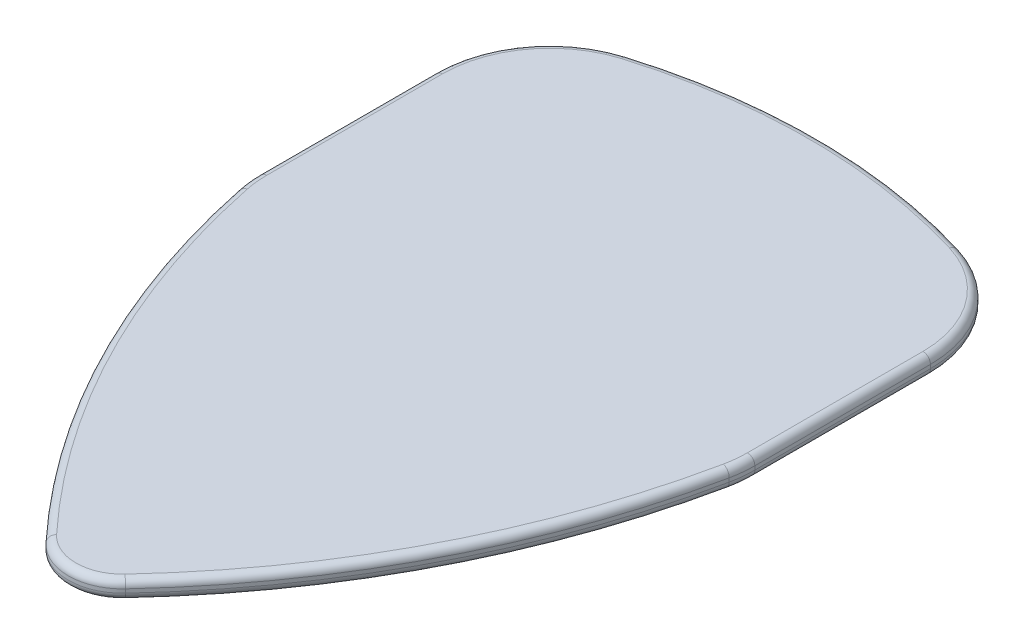
ISO-10303-21;
HEADER;
FILE_DESCRIPTION(('STEP AP214'),'2;1');
FILE_NAME('part.step','',(''),(''),'','','');
FILE_SCHEMA(('AUTOMOTIVE_DESIGN { 1 0 10303 214 1 1 1 1 }'));
ENDSEC;
DATA;
#1=APPLICATION_CONTEXT('core data for automotive mechanical design processes');
#2=APPLICATION_PROTOCOL_DEFINITION('international standard','automotive_design',2000,#1);
#3=PRODUCT_CONTEXT('',#1,'mechanical');
#4=PRODUCT('Part','Part','',(#3));
#5=PRODUCT_RELATED_PRODUCT_CATEGORY('part','',(#4));
#6=PRODUCT_DEFINITION_FORMATION('','',#4);
#7=PRODUCT_DEFINITION_CONTEXT('part definition',#1,'design');
#8=PRODUCT_DEFINITION('design','',#6,#7);
#9=PRODUCT_DEFINITION_SHAPE('','',#8);
#10=(LENGTH_UNIT() NAMED_UNIT(*) SI_UNIT(.MILLI.,.METRE.));
#11=(NAMED_UNIT(*) PLANE_ANGLE_UNIT() SI_UNIT($,.RADIAN.));
#12=(NAMED_UNIT(*) SI_UNIT($,.STERADIAN.) SOLID_ANGLE_UNIT());
#13=UNCERTAINTY_MEASURE_WITH_UNIT(LENGTH_MEASURE(1.E-05),#10,'distance_accuracy_value','');
#14=(GEOMETRIC_REPRESENTATION_CONTEXT(3) GLOBAL_UNCERTAINTY_ASSIGNED_CONTEXT((#13)) GLOBAL_UNIT_ASSIGNED_CONTEXT((#10,
#11,#12)) REPRESENTATION_CONTEXT('',''));
#15=CARTESIAN_POINT('',(0.,0.,0.));
#16=DIRECTION('',(0.,0.,1.));
#17=DIRECTION('',(1.,0.,0.));
#18=AXIS2_PLACEMENT_3D('',#15,#16,#17);
#19=CARTESIAN_POINT('',(-7.09730033956618,1.,-23.4285878338835));
#20=DIRECTION('',(0.,-1.,0.));
#21=DIRECTION('',(0.,0.,-1.));
#22=AXIS2_PLACEMENT_3D('',#19,#20,#21);
#23=CYLINDRICAL_SURFACE('',#22,6.14);
#24=DIRECTION('',(0.,-1.,0.));
#25=VECTOR('',#24,1.);
#26=CARTESIAN_POINT('',(-13.2373003395662,1.,-23.4285878338835));
#27=LINE('',#26,#25);
#28=CARTESIAN_POINT('',(-13.2373003395662,0.6,-23.4285878338835));
#29=VERTEX_POINT('',#28);
#30=CARTESIAN_POINT('',(-13.2373003395662,0.4,-23.4285878338835));
#31=VERTEX_POINT('',#30);
#32=EDGE_CURVE('E349',#29,#31,#27,.T.);
#33=ORIENTED_EDGE('',*,*,#32,.T.);
#34=CARTESIAN_POINT('',(-7.09730033956618,0.4,-23.4285878338835));
#35=DIRECTION('',(0.,-1.,0.));
#36=DIRECTION('',(0.,0.,-1.));
#37=AXIS2_PLACEMENT_3D('',#34,#35,#36);
#38=CIRCLE('',#37,6.14);
#39=CARTESIAN_POINT('',(-13.11,0.4,-22.1847860838369));
#40=VERTEX_POINT('',#39);
#41=EDGE_CURVE('E266',#31,#40,#38,.F.);
#42=ORIENTED_EDGE('',*,*,#41,.T.);
#43=DIRECTION('',(0.,-1.,0.));
#44=VECTOR('',#43,1.);
#45=CARTESIAN_POINT('',(-13.11,1.,-22.1847860838369));
#46=LINE('',#45,#44);
#47=CARTESIAN_POINT('',(-13.11,0.6,-22.1847860838369));
#48=VERTEX_POINT('',#47);
#49=EDGE_CURVE('E193',#48,#40,#46,.T.);
#50=ORIENTED_EDGE('',*,*,#49,.F.);
#51=CARTESIAN_POINT('',(-7.09730033956618,0.6,-23.4285878338835));
#52=DIRECTION('',(0.,-1.,0.));
#53=DIRECTION('',(0.,0.,-1.));
#54=AXIS2_PLACEMENT_3D('',#51,#52,#53);
#55=CIRCLE('',#54,6.14);
#56=EDGE_CURVE('E264',#48,#29,#55,.T.);
#57=ORIENTED_EDGE('',*,*,#56,.T.);
#58=EDGE_LOOP('',(#33,#42,#50,#57));
#59=FACE_BOUND('',#58,.T.);
#60=ADVANCED_FACE('F33',(#59),#23,.T.);
#61=CARTESIAN_POINT('',(7.09730033956618,1.,-23.4285878338835));
#62=DIRECTION('',(0.,-1.,0.));
#63=DIRECTION('',(0.,0.,-1.));
#64=AXIS2_PLACEMENT_3D('',#61,#62,#63);
#65=CYLINDRICAL_SURFACE('',#64,6.14);
#66=DIRECTION('',(0.,-1.,0.));
#67=VECTOR('',#66,1.);
#68=CARTESIAN_POINT('',(13.11,1.,-22.1847860838369));
#69=LINE('',#68,#67);
#70=CARTESIAN_POINT('',(13.11,0.6,-22.1847860838369));
#71=VERTEX_POINT('',#70);
#72=CARTESIAN_POINT('',(13.11,0.4,-22.1847860838369));
#73=VERTEX_POINT('',#72);
#74=EDGE_CURVE('E342',#71,#73,#69,.T.);
#75=ORIENTED_EDGE('',*,*,#74,.T.);
#76=CARTESIAN_POINT('',(7.09730033956618,0.4,-23.4285878338835));
#77=DIRECTION('',(0.,-1.,0.));
#78=DIRECTION('',(0.,0.,-1.));
#79=AXIS2_PLACEMENT_3D('',#76,#77,#78);
#80=CIRCLE('',#79,6.14);
#81=CARTESIAN_POINT('',(13.2373003395662,0.4,-23.4285878338835));
#82=VERTEX_POINT('',#81);
#83=EDGE_CURVE('E241',#73,#82,#80,.F.);
#84=ORIENTED_EDGE('',*,*,#83,.T.);
#85=DIRECTION('',(0.,-1.,0.));
#86=VECTOR('',#85,1.);
#87=CARTESIAN_POINT('',(13.2373003395662,1.,-23.4285878338835));
#88=LINE('',#87,#86);
#89=CARTESIAN_POINT('',(13.2373003395662,0.6,-23.4285878338835));
#90=VERTEX_POINT('',#89);
#91=EDGE_CURVE('E354',#90,#82,#88,.T.);
#92=ORIENTED_EDGE('',*,*,#91,.F.);
#93=CARTESIAN_POINT('',(7.09730033956618,0.6,-23.4285878338835));
#94=DIRECTION('',(0.,-1.,0.));
#95=DIRECTION('',(0.,0.,-1.));
#96=AXIS2_PLACEMENT_3D('',#93,#94,#95);
#97=CIRCLE('',#96,6.14);
#98=EDGE_CURVE('E239',#90,#71,#97,.T.);
#99=ORIENTED_EDGE('',*,*,#98,.T.);
#100=EDGE_LOOP('',(#75,#84,#92,#99));
#101=FACE_BOUND('',#100,.T.);
#102=ADVANCED_FACE('F424',(#101),#65,.T.);
#103=CARTESIAN_POINT('',(30.3498714869794,1.,-31.17500133906));
#104=DIRECTION('',(0.,-1.,0.));
#105=DIRECTION('',(0.,0.,-1.));
#106=AXIS2_PLACEMENT_3D('',#103,#104,#105);
#107=CYLINDRICAL_SURFACE('',#106,44.3800000000001);
#108=ORIENTED_EDGE('',*,*,#49,.T.);
#109=CARTESIAN_POINT('',(30.3498714869794,0.4,-31.17500133906));
#110=DIRECTION('',(0.,-1.,0.));
#111=DIRECTION('',(0.,0.,-1.));
#112=AXIS2_PLACEMENT_3D('',#109,#110,#111);
#113=CIRCLE('',#112,44.3800000000001);
#114=CARTESIAN_POINT('',(-2.1218569747406,0.4,-0.92320386009465));
#115=VERTEX_POINT('',#114);
#116=EDGE_CURVE('E192',#40,#115,#113,.F.);
#117=ORIENTED_EDGE('',*,*,#116,.T.);
#118=DIRECTION('',(0.,-1.,0.));
#119=VECTOR('',#118,1.);
#120=CARTESIAN_POINT('',(-2.1218569747406,1.,-0.92320386009465));
#121=LINE('',#120,#119);
#122=CARTESIAN_POINT('',(-2.1218569747406,0.6,-0.92320386009465));
#123=VERTEX_POINT('',#122);
#124=EDGE_CURVE('E174',#123,#115,#121,.T.);
#125=ORIENTED_EDGE('',*,*,#124,.F.);
#126=CARTESIAN_POINT('',(30.3498714869794,0.6,-31.17500133906));
#127=DIRECTION('',(0.,-1.,0.));
#128=DIRECTION('',(0.,0.,-1.));
#129=AXIS2_PLACEMENT_3D('',#126,#127,#128);
#130=CIRCLE('',#129,44.3800000000001);
#131=EDGE_CURVE('E189',#123,#48,#130,.T.);
#132=ORIENTED_EDGE('',*,*,#131,.T.);
#133=EDGE_LOOP('',(#108,#117,#125,#132));
#134=FACE_BOUND('',#133,.T.);
#135=ADVANCED_FACE('F187',(#134),#107,.T.);
#136=CARTESIAN_POINT('',(0.,1.,-2.9));
#137=DIRECTION('',(0.,-1.,0.));
#138=DIRECTION('',(0.,0.,-1.));
#139=AXIS2_PLACEMENT_3D('',#136,#137,#138);
#140=CYLINDRICAL_SURFACE('',#139,2.9);
#141=ORIENTED_EDGE('',*,*,#124,.T.);
#142=CARTESIAN_POINT('',(0.,0.4,-2.9));
#143=DIRECTION('',(0.,-1.,0.));
#144=DIRECTION('',(0.,0.,-1.));
#145=AXIS2_PLACEMENT_3D('',#142,#143,#144);
#146=CIRCLE('',#145,2.9);
#147=CARTESIAN_POINT('',(2.12185697474061,0.4,-0.923203860094646));
#148=VERTEX_POINT('',#147);
#149=EDGE_CURVE('E181',#115,#148,#146,.F.);
#150=ORIENTED_EDGE('',*,*,#149,.T.);
#151=DIRECTION('',(0.,-1.,0.));
#152=VECTOR('',#151,1.);
#153=CARTESIAN_POINT('',(2.12185697474061,1.,-0.923203860094646));
#154=LINE('',#153,#152);
#155=CARTESIAN_POINT('',(2.12185697474061,0.6,-0.923203860094646));
#156=VERTEX_POINT('',#155);
#157=EDGE_CURVE('E176',#156,#148,#154,.T.);
#158=ORIENTED_EDGE('',*,*,#157,.F.);
#159=CARTESIAN_POINT('',(0.,0.6,-2.9));
#160=DIRECTION('',(0.,-1.,0.));
#161=DIRECTION('',(0.,0.,-1.));
#162=AXIS2_PLACEMENT_3D('',#159,#160,#161);
#163=CIRCLE('',#162,2.9);
#164=EDGE_CURVE('E171',#156,#123,#163,.T.);
#165=ORIENTED_EDGE('',*,*,#164,.T.);
#166=EDGE_LOOP('',(#141,#150,#158,#165));
#167=FACE_BOUND('',#166,.T.);
#168=ADVANCED_FACE('F173',(#167),#140,.T.);
#169=CARTESIAN_POINT('',(-30.3498714869793,1.,-31.17500133906));
#170=DIRECTION('',(0.,-1.,0.));
#171=DIRECTION('',(0.,0.,-1.));
#172=AXIS2_PLACEMENT_3D('',#169,#170,#171);
#173=CYLINDRICAL_SURFACE('',#172,44.38);
#174=ORIENTED_EDGE('',*,*,#157,.T.);
#175=CARTESIAN_POINT('',(-30.3498714869793,0.4,-31.17500133906));
#176=DIRECTION('',(0.,-1.,0.));
#177=DIRECTION('',(0.,0.,-1.));
#178=AXIS2_PLACEMENT_3D('',#175,#176,#177);
#179=CIRCLE('',#178,44.38);
#180=EDGE_CURVE('E237',#148,#73,#179,.F.);
#181=ORIENTED_EDGE('',*,*,#180,.T.);
#182=ORIENTED_EDGE('',*,*,#74,.F.);
#183=CARTESIAN_POINT('',(-30.3498714869793,0.6,-31.17500133906));
#184=DIRECTION('',(0.,-1.,0.));
#185=DIRECTION('',(0.,0.,-1.));
#186=AXIS2_PLACEMENT_3D('',#183,#184,#185);
#187=CIRCLE('',#186,44.38);
#188=EDGE_CURVE('E235',#71,#156,#187,.T.);
#189=ORIENTED_EDGE('',*,*,#188,.T.);
#190=EDGE_LOOP('',(#174,#181,#182,#189));
#191=FACE_BOUND('',#190,.T.);
#192=ADVANCED_FACE('F339',(#191),#173,.T.);
#193=CARTESIAN_POINT('',(-3.54865016978309,1.,-11.7142939169418));
#194=DIRECTION('',(0.,-1.,0.));
#195=DIRECTION('',(0.,0.,-1.));
#196=AXIS2_PLACEMENT_3D('',#193,#194,#195);
#197=PLANE('',#196);
#198=CARTESIAN_POINT('',(0.,1.,-9.38000000000001));
#199=DIRECTION('',(0.,-1.,0.));
#200=DIRECTION('',(0.,0.,-1.));
#201=AXIS2_PLACEMENT_3D('',#198,#199,#200);
#202=CIRCLE('',#201,30.22);
#203=CARTESIAN_POINT('',(8.76145491265074,1.,-38.3020557328415));
#204=VERTEX_POINT('',#203);
#205=CARTESIAN_POINT('',(-8.76145491265075,1.,-38.3020557328415));
#206=VERTEX_POINT('',#205);
#207=EDGE_CURVE('E42',#204,#206,#202,.F.);
#208=ORIENTED_EDGE('',*,*,#207,.T.);
#209=CARTESIAN_POINT('',(-7.09730033956618,1.,-32.8085878338835));
#210=DIRECTION('',(0.,-1.,0.));
#211=DIRECTION('',(0.,0.,-1.));
#212=AXIS2_PLACEMENT_3D('',#209,#210,#211);
#213=CIRCLE('',#212,5.74);
#214=CARTESIAN_POINT('',(-12.8373003395662,1.,-32.8085878338835));
#215=VERTEX_POINT('',#214);
#216=EDGE_CURVE('E11',#206,#215,#213,.F.);
#217=ORIENTED_EDGE('',*,*,#216,.T.);
#218=DIRECTION('',(0.,0.,1.));
#219=VECTOR('',#218,1.);
#220=CARTESIAN_POINT('',(-12.8373003395662,1.,-11.7142939169418));
#221=LINE('',#220,#219);
#222=CARTESIAN_POINT('',(-12.8373003395662,1.,-23.4285878338835));
#223=VERTEX_POINT('',#222);
#224=EDGE_CURVE('E268',#215,#223,#221,.T.);
#225=ORIENTED_EDGE('',*,*,#224,.T.);
#226=CARTESIAN_POINT('',(-7.09730033956618,1.,-23.4285878338835));
#227=DIRECTION('',(0.,-1.,0.));
#228=DIRECTION('',(0.,0.,-1.));
#229=AXIS2_PLACEMENT_3D('',#226,#227,#228);
#230=CIRCLE('',#229,5.73999999999999);
#231=CARTESIAN_POINT('',(-12.7182931817307,1.,-22.2658155138073));
#232=VERTEX_POINT('',#231);
#233=EDGE_CURVE('E270',#223,#232,#230,.F.);
#234=ORIENTED_EDGE('',*,*,#233,.T.);
#235=CARTESIAN_POINT('',(30.3498714869794,1.,-31.17500133906));
#236=DIRECTION('',(0.,-1.,0.));
#237=DIRECTION('',(0.,0.,-1.));
#238=AXIS2_PLACEMENT_3D('',#235,#236,#237);
#239=CIRCLE('',#238,43.9800000000001);
#240=CARTESIAN_POINT('',(-1.82918704719017,1.,-1.19586539663332));
#241=VERTEX_POINT('',#240);
#242=EDGE_CURVE('E272',#232,#241,#239,.F.);
#243=ORIENTED_EDGE('',*,*,#242,.T.);
#244=CARTESIAN_POINT('',(0.,1.,-2.9));
#245=DIRECTION('',(0.,-1.,0.));
#246=DIRECTION('',(0.,0.,-1.));
#247=AXIS2_PLACEMENT_3D('',#244,#245,#246);
#248=CIRCLE('',#247,2.5);
#249=CARTESIAN_POINT('',(1.82918704719017,1.,-1.19586539663332));
#250=VERTEX_POINT('',#249);
#251=EDGE_CURVE('E199',#241,#250,#248,.F.);
#252=ORIENTED_EDGE('',*,*,#251,.T.);
#253=CARTESIAN_POINT('',(-30.3498714869793,1.,-31.17500133906));
#254=DIRECTION('',(0.,-1.,0.));
#255=DIRECTION('',(0.,0.,-1.));
#256=AXIS2_PLACEMENT_3D('',#253,#254,#255);
#257=CIRCLE('',#256,43.98);
#258=CARTESIAN_POINT('',(12.7182931817307,1.,-22.2658155138073));
#259=VERTEX_POINT('',#258);
#260=EDGE_CURVE('E275',#250,#259,#257,.F.);
#261=ORIENTED_EDGE('',*,*,#260,.T.);
#262=CARTESIAN_POINT('',(7.09730033956618,1.,-23.4285878338835));
#263=DIRECTION('',(0.,-1.,0.));
#264=DIRECTION('',(0.,0.,-1.));
#265=AXIS2_PLACEMENT_3D('',#262,#263,#264);
#266=CIRCLE('',#265,5.74);
#267=CARTESIAN_POINT('',(12.8373003395662,1.,-23.4285878338835));
#268=VERTEX_POINT('',#267);
#269=EDGE_CURVE('E277',#259,#268,#266,.F.);
#270=ORIENTED_EDGE('',*,*,#269,.T.);
#271=DIRECTION('',(0.,0.,1.));
#272=VECTOR('',#271,1.);
#273=CARTESIAN_POINT('',(12.8373003395662,1.,-32.8085878338835));
#274=LINE('',#273,#272);
#275=CARTESIAN_POINT('',(12.8373003395662,1.,-32.8085878338835));
#276=VERTEX_POINT('',#275);
#277=EDGE_CURVE('E279',#268,#276,#274,.F.);
#278=ORIENTED_EDGE('',*,*,#277,.T.);
#279=CARTESIAN_POINT('',(7.09730033956618,1.,-32.8085878338835));
#280=DIRECTION('',(0.,-1.,0.));
#281=DIRECTION('',(0.,0.,-1.));
#282=AXIS2_PLACEMENT_3D('',#279,#280,#281);
#283=CIRCLE('',#282,5.74);
#284=EDGE_CURVE('E53',#276,#204,#283,.F.);
#285=ORIENTED_EDGE('',*,*,#284,.T.);
#286=EDGE_LOOP('',(#208,#217,#225,#234,#243,#252,#261,#270,#278,#285));
#287=FACE_BOUND('',#286,.T.);
#288=ADVANCED_FACE('F659',(#287),#197,.F.);
#289=CARTESIAN_POINT('',(-3.54865016978309,0.,-11.7142939169418));
#290=DIRECTION('',(0.,-1.,0.));
#291=DIRECTION('',(0.,0.,-1.));
#292=AXIS2_PLACEMENT_3D('',#289,#290,#291);
#293=PLANE('',#292);
#294=CARTESIAN_POINT('',(0.,0.,-2.9));
#295=DIRECTION('',(0.,-1.,0.));
#296=DIRECTION('',(0.,0.,-1.));
#297=AXIS2_PLACEMENT_3D('',#294,#295,#296);
#298=CIRCLE('',#297,2.5);
#299=CARTESIAN_POINT('',(1.82918704719018,0.,-1.19586539663331));
#300=VERTEX_POINT('',#299);
#301=CARTESIAN_POINT('',(-1.82918704719017,0.,-1.19586539663332));
#302=VERTEX_POINT('',#301);
#303=EDGE_CURVE('E230',#300,#302,#298,.T.);
#304=ORIENTED_EDGE('',*,*,#303,.T.);
#305=CARTESIAN_POINT('',(30.3498714869794,0.,-31.17500133906));
#306=DIRECTION('',(0.,-1.,0.));
#307=DIRECTION('',(0.,0.,-1.));
#308=AXIS2_PLACEMENT_3D('',#305,#306,#307);
#309=CIRCLE('',#308,43.9800000000001);
#310=CARTESIAN_POINT('',(-12.7182931817307,0.,-22.2658155138073));
#311=VERTEX_POINT('',#310);
#312=EDGE_CURVE('E182',#302,#311,#309,.T.);
#313=ORIENTED_EDGE('',*,*,#312,.T.);
#314=CARTESIAN_POINT('',(-7.09730033956618,0.,-23.4285878338835));
#315=DIRECTION('',(0.,-1.,0.));
#316=DIRECTION('',(0.,0.,-1.));
#317=AXIS2_PLACEMENT_3D('',#314,#315,#316);
#318=CIRCLE('',#317,5.73999999999999);
#319=CARTESIAN_POINT('',(-12.8373003395662,0.,-23.4285878338835));
#320=VERTEX_POINT('',#319);
#321=EDGE_CURVE('E211',#311,#320,#318,.T.);
#322=ORIENTED_EDGE('',*,*,#321,.T.);
#323=DIRECTION('',(0.,0.,1.));
#324=VECTOR('',#323,1.);
#325=CARTESIAN_POINT('',(-12.8373003395662,0.,-32.8085878338835));
#326=LINE('',#325,#324);
#327=CARTESIAN_POINT('',(-12.8373003395662,0.,-32.8085878338835));
#328=VERTEX_POINT('',#327);
#329=EDGE_CURVE('E216',#320,#328,#326,.F.);
#330=ORIENTED_EDGE('',*,*,#329,.T.);
#331=CARTESIAN_POINT('',(-7.09730033956618,0.,-32.8085878338835));
#332=DIRECTION('',(0.,-1.,0.));
#333=DIRECTION('',(0.,0.,-1.));
#334=AXIS2_PLACEMENT_3D('',#331,#332,#333);
#335=CIRCLE('',#334,5.74);
#336=CARTESIAN_POINT('',(-8.76145491265075,0.,-38.3020557328415));
#337=VERTEX_POINT('',#336);
#338=EDGE_CURVE('E218',#328,#337,#335,.T.);
#339=ORIENTED_EDGE('',*,*,#338,.T.);
#340=CARTESIAN_POINT('',(0.,0.,-9.38000000000001));
#341=DIRECTION('',(0.,-1.,0.));
#342=DIRECTION('',(0.,0.,-1.));
#343=AXIS2_PLACEMENT_3D('',#340,#341,#342);
#344=CIRCLE('',#343,30.22);
#345=CARTESIAN_POINT('',(8.76145491265074,0.,-38.3020557328415));
#346=VERTEX_POINT('',#345);
#347=EDGE_CURVE('E220',#337,#346,#344,.T.);
#348=ORIENTED_EDGE('',*,*,#347,.T.);
#349=CARTESIAN_POINT('',(7.09730033956618,0.,-32.8085878338835));
#350=DIRECTION('',(0.,-1.,0.));
#351=DIRECTION('',(0.,0.,-1.));
#352=AXIS2_PLACEMENT_3D('',#349,#350,#351);
#353=CIRCLE('',#352,5.74);
#354=CARTESIAN_POINT('',(12.8373003395662,0.,-32.8085878338835));
#355=VERTEX_POINT('',#354);
#356=EDGE_CURVE('E222',#346,#355,#353,.T.);
#357=ORIENTED_EDGE('',*,*,#356,.T.);
#358=DIRECTION('',(0.,0.,1.));
#359=VECTOR('',#358,1.);
#360=CARTESIAN_POINT('',(12.8373003395662,0.,-11.7142939169418));
#361=LINE('',#360,#359);
#362=CARTESIAN_POINT('',(12.8373003395662,0.,-23.4285878338835));
#363=VERTEX_POINT('',#362);
#364=EDGE_CURVE('E224',#355,#363,#361,.T.);
#365=ORIENTED_EDGE('',*,*,#364,.T.);
#366=CARTESIAN_POINT('',(7.09730033956618,0.,-23.4285878338835));
#367=DIRECTION('',(0.,-1.,0.));
#368=DIRECTION('',(0.,0.,-1.));
#369=AXIS2_PLACEMENT_3D('',#366,#367,#368);
#370=CIRCLE('',#369,5.74);
#371=CARTESIAN_POINT('',(12.7182931817307,0.,-22.2658155138073));
#372=VERTEX_POINT('',#371);
#373=EDGE_CURVE('E226',#363,#372,#370,.T.);
#374=ORIENTED_EDGE('',*,*,#373,.T.);
#375=CARTESIAN_POINT('',(-30.3498714869793,0.,-31.17500133906));
#376=DIRECTION('',(0.,-1.,0.));
#377=DIRECTION('',(0.,0.,-1.));
#378=AXIS2_PLACEMENT_3D('',#375,#376,#377);
#379=CIRCLE('',#378,43.98);
#380=EDGE_CURVE('E228',#372,#300,#379,.T.);
#381=ORIENTED_EDGE('',*,*,#380,.T.);
#382=EDGE_LOOP('',(#304,#313,#322,#330,#339,#348,#357,#365,#374,#381));
#383=FACE_BOUND('',#382,.T.);
#384=ADVANCED_FACE('F436',(#383),#293,.T.);
#385=CARTESIAN_POINT('',(-7.09730033956618,1.,-32.8085878338835));
#386=DIRECTION('',(0.,-1.,0.));
#387=DIRECTION('',(0.,0.,-1.));
#388=AXIS2_PLACEMENT_3D('',#385,#386,#387);
#389=CYLINDRICAL_SURFACE('',#388,6.14);
#390=DIRECTION('',(0.,-1.,0.));
#391=VECTOR('',#390,1.);
#392=CARTESIAN_POINT('',(-8.87742387244758,1.,-38.6848757954866));
#393=LINE('',#392,#391);
#394=CARTESIAN_POINT('',(-8.87742387244758,0.6,-38.6848757954866));
#395=VERTEX_POINT('',#394);
#396=CARTESIAN_POINT('',(-8.87742387244758,0.4,-38.6848757954866));
#397=VERTEX_POINT('',#396);
#398=EDGE_CURVE('E311',#395,#397,#393,.T.);
#399=ORIENTED_EDGE('',*,*,#398,.T.);
#400=CARTESIAN_POINT('',(-7.09730033956618,0.4,-32.8085878338835));
#401=DIRECTION('',(0.,-1.,0.));
#402=DIRECTION('',(0.,0.,-1.));
#403=AXIS2_PLACEMENT_3D('',#400,#401,#402);
#404=CIRCLE('',#403,6.14);
#405=CARTESIAN_POINT('',(-13.2373003395662,0.4,-32.8085878338835));
#406=VERTEX_POINT('',#405);
#407=EDGE_CURVE('E258',#397,#406,#404,.F.);
#408=ORIENTED_EDGE('',*,*,#407,.T.);
#409=DIRECTION('',(0.,-1.,0.));
#410=VECTOR('',#409,1.);
#411=CARTESIAN_POINT('',(-13.2373003395662,1.,-32.8085878338835));
#412=LINE('',#411,#410);
#413=CARTESIAN_POINT('',(-13.2373003395662,0.6,-32.8085878338835));
#414=VERTEX_POINT('',#413);
#415=EDGE_CURVE('E345',#414,#406,#412,.T.);
#416=ORIENTED_EDGE('',*,*,#415,.F.);
#417=CARTESIAN_POINT('',(-7.09730033956618,0.6,-32.8085878338835));
#418=DIRECTION('',(0.,-1.,0.));
#419=DIRECTION('',(0.,0.,-1.));
#420=AXIS2_PLACEMENT_3D('',#417,#418,#419);
#421=CIRCLE('',#420,6.14);
#422=EDGE_CURVE('E255',#414,#395,#421,.T.);
#423=ORIENTED_EDGE('',*,*,#422,.T.);
#424=EDGE_LOOP('',(#399,#408,#416,#423));
#425=FACE_BOUND('',#424,.T.);
#426=ADVANCED_FACE('F367',(#425),#389,.T.);
#427=CARTESIAN_POINT('',(-13.2373003395662,1.,-32.8085878338835));
#428=DIRECTION('',(1.,0.,0.));
#429=DIRECTION('',(0.,0.,-1.));
#430=AXIS2_PLACEMENT_3D('',#427,#428,#429);
#431=PLANE('',#430);
#432=ORIENTED_EDGE('',*,*,#415,.T.);
#433=DIRECTION('',(0.,0.,1.));
#434=VECTOR('',#433,1.);
#435=CARTESIAN_POINT('',(-13.2373003395662,0.4,-23.4285878338835));
#436=LINE('',#435,#434);
#437=EDGE_CURVE('E262',#406,#31,#436,.T.);
#438=ORIENTED_EDGE('',*,*,#437,.T.);
#439=ORIENTED_EDGE('',*,*,#32,.F.);
#440=DIRECTION('',(0.,0.,1.));
#441=VECTOR('',#440,1.);
#442=CARTESIAN_POINT('',(-13.2373003395662,0.6,-32.8085878338835));
#443=LINE('',#442,#441);
#444=EDGE_CURVE('E260',#29,#414,#443,.F.);
#445=ORIENTED_EDGE('',*,*,#444,.T.);
#446=EDGE_LOOP('',(#432,#438,#439,#445));
#447=FACE_BOUND('',#446,.T.);
#448=ADVANCED_FACE('F388',(#447),#431,.F.);
#449=CARTESIAN_POINT('',(13.2373003395662,1.,-32.8085878338835));
#450=DIRECTION('',(1.,0.,0.));
#451=DIRECTION('',(0.,0.,-1.));
#452=AXIS2_PLACEMENT_3D('',#449,#450,#451);
#453=PLANE('',#452);
#454=ORIENTED_EDGE('',*,*,#91,.T.);
#455=DIRECTION('',(0.,0.,1.));
#456=VECTOR('',#455,1.);
#457=CARTESIAN_POINT('',(13.2373003395662,0.4,-32.8085878338835));
#458=LINE('',#457,#456);
#459=CARTESIAN_POINT('',(13.2373003395662,0.4,-32.8085878338835));
#460=VERTEX_POINT('',#459);
#461=EDGE_CURVE('E245',#82,#460,#458,.F.);
#462=ORIENTED_EDGE('',*,*,#461,.T.);
#463=DIRECTION('',(0.,-1.,0.));
#464=VECTOR('',#463,1.);
#465=CARTESIAN_POINT('',(13.2373003395662,1.,-32.8085878338835));
#466=LINE('',#465,#464);
#467=CARTESIAN_POINT('',(13.2373003395662,0.6,-32.8085878338835));
#468=VERTEX_POINT('',#467);
#469=EDGE_CURVE('E357',#468,#460,#466,.T.);
#470=ORIENTED_EDGE('',*,*,#469,.F.);
#471=DIRECTION('',(0.,0.,1.));
#472=VECTOR('',#471,1.);
#473=CARTESIAN_POINT('',(13.2373003395662,0.6,-23.4285878338835));
#474=LINE('',#473,#472);
#475=EDGE_CURVE('E243',#468,#90,#474,.T.);
#476=ORIENTED_EDGE('',*,*,#475,.T.);
#477=EDGE_LOOP('',(#454,#462,#470,#476));
#478=FACE_BOUND('',#477,.T.);
#479=ADVANCED_FACE('F422',(#478),#453,.T.);
#480=CARTESIAN_POINT('',(7.09730033956618,1.,-32.8085878338835));
#481=DIRECTION('',(0.,-1.,0.));
#482=DIRECTION('',(0.,0.,-1.));
#483=AXIS2_PLACEMENT_3D('',#480,#481,#482);
#484=CYLINDRICAL_SURFACE('',#483,6.14);
#485=ORIENTED_EDGE('',*,*,#469,.T.);
#486=CARTESIAN_POINT('',(7.09730033956618,0.4,-32.8085878338835));
#487=DIRECTION('',(0.,-1.,0.));
#488=DIRECTION('',(0.,0.,-1.));
#489=AXIS2_PLACEMENT_3D('',#486,#487,#488);
#490=CIRCLE('',#489,6.14);
#491=CARTESIAN_POINT('',(8.87742387244757,0.4,-38.6848757954866));
#492=VERTEX_POINT('',#491);
#493=EDGE_CURVE('E249',#460,#492,#490,.F.);
#494=ORIENTED_EDGE('',*,*,#493,.T.);
#495=DIRECTION('',(0.,-1.,0.));
#496=VECTOR('',#495,1.);
#497=CARTESIAN_POINT('',(8.87742387244757,1.,-38.6848757954866));
#498=LINE('',#497,#496);
#499=CARTESIAN_POINT('',(8.87742387244757,0.6,-38.6848757954866));
#500=VERTEX_POINT('',#499);
#501=EDGE_CURVE('E360',#500,#492,#498,.T.);
#502=ORIENTED_EDGE('',*,*,#501,.F.);
#503=CARTESIAN_POINT('',(7.09730033956618,0.6,-32.8085878338835));
#504=DIRECTION('',(0.,-1.,0.));
#505=DIRECTION('',(0.,0.,-1.));
#506=AXIS2_PLACEMENT_3D('',#503,#504,#505);
#507=CIRCLE('',#506,6.14);
#508=EDGE_CURVE('E247',#500,#468,#507,.T.);
#509=ORIENTED_EDGE('',*,*,#508,.T.);
#510=EDGE_LOOP('',(#485,#494,#502,#509));
#511=FACE_BOUND('',#510,.T.);
#512=ADVANCED_FACE('F410',(#511),#484,.T.);
#513=CARTESIAN_POINT('',(0.,1.,-9.38000000000001));
#514=DIRECTION('',(0.,-1.,0.));
#515=DIRECTION('',(0.,0.,-1.));
#516=AXIS2_PLACEMENT_3D('',#513,#514,#515);
#517=CYLINDRICAL_SURFACE('',#516,30.62);
#518=ORIENTED_EDGE('',*,*,#501,.T.);
#519=CARTESIAN_POINT('',(0.,0.4,-9.38000000000001));
#520=DIRECTION('',(0.,-1.,0.));
#521=DIRECTION('',(0.,0.,-1.));
#522=AXIS2_PLACEMENT_3D('',#519,#520,#521);
#523=CIRCLE('',#522,30.62);
#524=EDGE_CURVE('E253',#492,#397,#523,.F.);
#525=ORIENTED_EDGE('',*,*,#524,.T.);
#526=ORIENTED_EDGE('',*,*,#398,.F.);
#527=CARTESIAN_POINT('',(0.,0.6,-9.38000000000001));
#528=DIRECTION('',(0.,-1.,0.));
#529=DIRECTION('',(0.,0.,-1.));
#530=AXIS2_PLACEMENT_3D('',#527,#528,#529);
#531=CIRCLE('',#530,30.62);
#532=EDGE_CURVE('E251',#395,#500,#531,.T.);
#533=ORIENTED_EDGE('',*,*,#532,.T.);
#534=EDGE_LOOP('',(#518,#525,#526,#533));
#535=FACE_BOUND('',#534,.T.);
#536=ADVANCED_FACE('F406',(#535),#517,.T.);
#537=CARTESIAN_POINT('',(7.09730033956618,0.4,-32.8085878338835));
#538=DIRECTION('',(0.,-1.,0.));
#539=DIRECTION('',(0.,0.,-1.));
#540=AXIS2_PLACEMENT_3D('',#537,#538,#539);
#541=TOROIDAL_SURFACE('',#540,5.74,0.4);
#542=CARTESIAN_POINT('',(12.8373003395662,0.4,-32.8085878338835));
#543=DIRECTION('',(0.,0.,1.));
#544=DIRECTION('',(1.,0.,0.));
#545=AXIS2_PLACEMENT_3D('',#542,#543,#544);
#546=CIRCLE('',#545,0.4);
#547=EDGE_CURVE('E305',#355,#460,#546,.T.);
#548=ORIENTED_EDGE('',*,*,#547,.F.);
#549=ORIENTED_EDGE('',*,*,#356,.F.);
#550=CARTESIAN_POINT('',(8.76145491265074,0.4,-38.3020557328415));
#551=DIRECTION('',(-0.957050156612887,0.,-0.289922399492085));
#552=DIRECTION('',(-0.289922399492085,0.,0.957050156612887));
#553=AXIS2_PLACEMENT_3D('',#550,#551,#552);
#554=CIRCLE('',#553,0.4);
#555=EDGE_CURVE('E308',#492,#346,#554,.T.);
#556=ORIENTED_EDGE('',*,*,#555,.F.);
#557=ORIENTED_EDGE('',*,*,#493,.F.);
#558=EDGE_LOOP('',(#548,#549,#556,#557));
#559=FACE_BOUND('',#558,.T.);
#560=ADVANCED_FACE('F444',(#559),#541,.T.);
#561=CARTESIAN_POINT('',(0.,0.4,-9.38000000000001));
#562=DIRECTION('',(0.,-1.,0.));
#563=DIRECTION('',(0.,0.,-1.));
#564=AXIS2_PLACEMENT_3D('',#561,#562,#563);
#565=TOROIDAL_SURFACE('',#564,30.22,0.4);
#566=ORIENTED_EDGE('',*,*,#555,.T.);
#567=ORIENTED_EDGE('',*,*,#347,.F.);
#568=CARTESIAN_POINT('',(-8.76145491265075,0.4,-38.3020557328415));
#569=DIRECTION('',(-0.957050156612887,0.,0.289922399492085));
#570=DIRECTION('',(0.289922399492085,0.,0.957050156612887));
#571=AXIS2_PLACEMENT_3D('',#568,#569,#570);
#572=CIRCLE('',#571,0.4);
#573=EDGE_CURVE('E302',#397,#337,#572,.T.);
#574=ORIENTED_EDGE('',*,*,#573,.F.);
#575=ORIENTED_EDGE('',*,*,#524,.F.);
#576=EDGE_LOOP('',(#566,#567,#574,#575));
#577=FACE_BOUND('',#576,.T.);
#578=ADVANCED_FACE('F375',(#577),#565,.T.);
#579=CARTESIAN_POINT('',(12.8373003395662,0.4,-11.7142939169418));
#580=DIRECTION('',(0.,0.,1.));
#581=DIRECTION('',(1.,0.,0.));
#582=AXIS2_PLACEMENT_3D('',#579,#580,#581);
#583=CYLINDRICAL_SURFACE('',#582,0.4);
#584=ORIENTED_EDGE('',*,*,#547,.T.);
#585=ORIENTED_EDGE('',*,*,#461,.F.);
#586=CARTESIAN_POINT('',(12.8373003395662,0.4,-23.4285878338835));
#587=DIRECTION('',(0.,0.,1.));
#588=DIRECTION('',(1.,0.,0.));
#589=AXIS2_PLACEMENT_3D('',#586,#587,#588);
#590=CIRCLE('',#589,0.4);
#591=EDGE_CURVE('E299',#363,#82,#590,.T.);
#592=ORIENTED_EDGE('',*,*,#591,.F.);
#593=ORIENTED_EDGE('',*,*,#364,.F.);
#594=EDGE_LOOP('',(#584,#585,#592,#593));
#595=FACE_BOUND('',#594,.T.);
#596=ADVANCED_FACE('F442',(#595),#583,.T.);
#597=CARTESIAN_POINT('',(-7.09730033956618,0.4,-32.8085878338835));
#598=DIRECTION('',(0.,-1.,0.));
#599=DIRECTION('',(0.,0.,-1.));
#600=AXIS2_PLACEMENT_3D('',#597,#598,#599);
#601=TOROIDAL_SURFACE('',#600,5.74,0.4);
#602=ORIENTED_EDGE('',*,*,#573,.T.);
#603=ORIENTED_EDGE('',*,*,#338,.F.);
#604=CARTESIAN_POINT('',(-12.8373003395662,0.4,-32.8085878338835));
#605=DIRECTION('',(0.,0.,1.));
#606=DIRECTION('',(1.,0.,0.));
#607=AXIS2_PLACEMENT_3D('',#604,#605,#606);
#608=CIRCLE('',#607,0.4);
#609=EDGE_CURVE('E296',#406,#328,#608,.T.);
#610=ORIENTED_EDGE('',*,*,#609,.F.);
#611=ORIENTED_EDGE('',*,*,#407,.F.);
#612=EDGE_LOOP('',(#602,#603,#610,#611));
#613=FACE_BOUND('',#612,.T.);
#614=ADVANCED_FACE('F379',(#613),#601,.T.);
#615=CARTESIAN_POINT('',(7.09730033956618,0.4,-23.4285878338835));
#616=DIRECTION('',(0.,-1.,0.));
#617=DIRECTION('',(0.,0.,-1.));
#618=AXIS2_PLACEMENT_3D('',#615,#616,#617);
#619=TOROIDAL_SURFACE('',#618,5.74,0.4);
#620=ORIENTED_EDGE('',*,*,#591,.T.);
#621=ORIENTED_EDGE('',*,*,#83,.F.);
#622=CARTESIAN_POINT('',(12.7182931817307,0.4,-22.2658155138073));
#623=DIRECTION('',(-0.202573574926172,0.,0.979267045673258));
#624=DIRECTION('',(0.979267045673258,0.,0.202573574926172));
#625=AXIS2_PLACEMENT_3D('',#622,#623,#624);
#626=CIRCLE('',#625,0.4);
#627=EDGE_CURVE('E293',#372,#73,#626,.T.);
#628=ORIENTED_EDGE('',*,*,#627,.F.);
#629=ORIENTED_EDGE('',*,*,#373,.F.);
#630=EDGE_LOOP('',(#620,#621,#628,#629));
#631=FACE_BOUND('',#630,.T.);
#632=ADVANCED_FACE('F427',(#631),#619,.T.);
#633=CARTESIAN_POINT('',(-12.8373003395662,0.4,-32.8085878338835));
#634=DIRECTION('',(0.,0.,-1.));
#635=DIRECTION('',(-1.,0.,0.));
#636=AXIS2_PLACEMENT_3D('',#633,#634,#635);
#637=CYLINDRICAL_SURFACE('',#636,0.4);
#638=ORIENTED_EDGE('',*,*,#609,.T.);
#639=ORIENTED_EDGE('',*,*,#329,.F.);
#640=CARTESIAN_POINT('',(-12.8373003395662,0.4,-23.4285878338835));
#641=DIRECTION('',(0.,0.,1.));
#642=DIRECTION('',(1.,0.,0.));
#643=AXIS2_PLACEMENT_3D('',#640,#641,#642);
#644=CIRCLE('',#643,0.4);
#645=EDGE_CURVE('E290',#31,#320,#644,.T.);
#646=ORIENTED_EDGE('',*,*,#645,.F.);
#647=ORIENTED_EDGE('',*,*,#437,.F.);
#648=EDGE_LOOP('',(#638,#639,#646,#647));
#649=FACE_BOUND('',#648,.T.);
#650=ADVANCED_FACE('F384',(#649),#637,.T.);
#651=CARTESIAN_POINT('',(-30.3498714869793,0.4,-31.17500133906));
#652=DIRECTION('',(0.,-1.,0.));
#653=DIRECTION('',(0.,0.,-1.));
#654=AXIS2_PLACEMENT_3D('',#651,#652,#653);
#655=TOROIDAL_SURFACE('',#654,43.98,0.4);
#656=ORIENTED_EDGE('',*,*,#627,.T.);
#657=ORIENTED_EDGE('',*,*,#180,.F.);
#658=CARTESIAN_POINT('',(1.82918704719018,0.4,-1.19586539663331));
#659=DIRECTION('',(-0.681653841346671,0.,0.731674818876068));
#660=DIRECTION('',(0.731674818876069,0.,0.681653841346671));
#661=AXIS2_PLACEMENT_3D('',#658,#659,#660);
#662=CIRCLE('',#661,0.4);
#663=EDGE_CURVE('E287',#300,#148,#662,.T.);
#664=ORIENTED_EDGE('',*,*,#663,.F.);
#665=ORIENTED_EDGE('',*,*,#380,.F.);
#666=EDGE_LOOP('',(#656,#657,#664,#665));
#667=FACE_BOUND('',#666,.T.);
#668=ADVANCED_FACE('F432',(#667),#655,.T.);
#669=CARTESIAN_POINT('',(-7.09730033956618,0.4,-23.4285878338835));
#670=DIRECTION('',(0.,-1.,0.));
#671=DIRECTION('',(0.,0.,-1.));
#672=AXIS2_PLACEMENT_3D('',#669,#670,#671);
#673=TOROIDAL_SURFACE('',#672,5.73999999999999,0.4);
#674=ORIENTED_EDGE('',*,*,#645,.T.);
#675=ORIENTED_EDGE('',*,*,#321,.F.);
#676=CARTESIAN_POINT('',(-12.7182931817307,0.4,-22.2658155138073));
#677=DIRECTION('',(0.202573574926164,0.,0.97926704567326));
#678=DIRECTION('',(0.97926704567326,0.,-0.202573574926164));
#679=AXIS2_PLACEMENT_3D('',#676,#677,#678);
#680=CIRCLE('',#679,0.4);
#681=EDGE_CURVE('E285',#40,#311,#680,.T.);
#682=ORIENTED_EDGE('',*,*,#681,.F.);
#683=ORIENTED_EDGE('',*,*,#41,.F.);
#684=EDGE_LOOP('',(#674,#675,#682,#683));
#685=FACE_BOUND('',#684,.T.);
#686=ADVANCED_FACE('F470',(#685),#673,.T.);
#687=CARTESIAN_POINT('',(0.,0.4,-2.9));
#688=DIRECTION('',(0.,-1.,0.));
#689=DIRECTION('',(0.,0.,-1.));
#690=AXIS2_PLACEMENT_3D('',#687,#688,#689);
#691=TOROIDAL_SURFACE('',#690,2.5,0.4);
#692=ORIENTED_EDGE('',*,*,#663,.T.);
#693=ORIENTED_EDGE('',*,*,#149,.F.);
#694=CARTESIAN_POINT('',(-1.82918704719017,0.4,-1.19586539663332));
#695=DIRECTION('',(-0.681653841346672,0.,-0.731674818876068));
#696=DIRECTION('',(-0.731674818876068,0.,0.681653841346672));
#697=AXIS2_PLACEMENT_3D('',#694,#695,#696);
#698=CIRCLE('',#697,0.4);
#699=EDGE_CURVE('E283',#302,#115,#698,.T.);
#700=ORIENTED_EDGE('',*,*,#699,.F.);
#701=ORIENTED_EDGE('',*,*,#303,.F.);
#702=EDGE_LOOP('',(#692,#693,#700,#701));
#703=FACE_BOUND('',#702,.T.);
#704=ADVANCED_FACE('F466',(#703),#691,.T.);
#705=CARTESIAN_POINT('',(30.3498714869794,0.4,-31.17500133906));
#706=DIRECTION('',(0.,-1.,0.));
#707=DIRECTION('',(0.,0.,-1.));
#708=AXIS2_PLACEMENT_3D('',#705,#706,#707);
#709=TOROIDAL_SURFACE('',#708,43.9800000000001,0.4);
#710=ORIENTED_EDGE('',*,*,#681,.T.);
#711=ORIENTED_EDGE('',*,*,#312,.F.);
#712=ORIENTED_EDGE('',*,*,#699,.T.);
#713=ORIENTED_EDGE('',*,*,#116,.F.);
#714=EDGE_LOOP('',(#710,#711,#712,#713));
#715=FACE_BOUND('',#714,.T.);
#716=ADVANCED_FACE('F463',(#715),#709,.T.);
#717=CARTESIAN_POINT('',(-30.3498714869793,0.6,-31.17500133906));
#718=DIRECTION('',(0.,-1.,0.));
#719=DIRECTION('',(0.,0.,-1.));
#720=AXIS2_PLACEMENT_3D('',#717,#718,#719);
#721=TOROIDAL_SURFACE('',#720,43.98,0.4);
#722=CARTESIAN_POINT('',(1.82918704719018,0.6,-1.19586539663331));
#723=DIRECTION('',(-0.681653841346672,0.,0.731674818876067));
#724=DIRECTION('',(0.731674818876067,0.,0.681653841346672));
#725=AXIS2_PLACEMENT_3D('',#722,#723,#724);
#726=CIRCLE('',#725,0.4);
#727=EDGE_CURVE('E326',#156,#250,#726,.T.);
#728=ORIENTED_EDGE('',*,*,#727,.F.);
#729=ORIENTED_EDGE('',*,*,#188,.F.);
#730=CARTESIAN_POINT('',(12.7182931817307,0.6,-22.2658155138073));
#731=DIRECTION('',(0.202573574926159,0.,-0.979267045673261));
#732=DIRECTION('',(-0.979267045673261,0.,-0.202573574926159));
#733=AXIS2_PLACEMENT_3D('',#730,#731,#732);
#734=CIRCLE('',#733,0.4);
#735=EDGE_CURVE('E37',#259,#71,#734,.T.);
#736=ORIENTED_EDGE('',*,*,#735,.F.);
#737=ORIENTED_EDGE('',*,*,#260,.F.);
#738=EDGE_LOOP('',(#728,#729,#736,#737));
#739=FACE_BOUND('',#738,.T.);
#740=ADVANCED_FACE('F35',(#739),#721,.T.);
#741=CARTESIAN_POINT('',(7.09730033956618,0.6,-23.4285878338835));
#742=DIRECTION('',(0.,-1.,0.));
#743=DIRECTION('',(0.,0.,-1.));
#744=AXIS2_PLACEMENT_3D('',#741,#742,#743);
#745=TOROIDAL_SURFACE('',#744,5.74,0.4);
#746=ORIENTED_EDGE('',*,*,#735,.T.);
#747=ORIENTED_EDGE('',*,*,#98,.F.);
#748=CARTESIAN_POINT('',(12.8373003395662,0.6,-23.4285878338835));
#749=DIRECTION('',(0.,0.,-1.));
#750=DIRECTION('',(-1.,0.,0.));
#751=AXIS2_PLACEMENT_3D('',#748,#749,#750);
#752=CIRCLE('',#751,0.4);
#753=EDGE_CURVE('E202',#268,#90,#752,.T.);
#754=ORIENTED_EDGE('',*,*,#753,.F.);
#755=ORIENTED_EDGE('',*,*,#269,.F.);
#756=EDGE_LOOP('',(#746,#747,#754,#755));
#757=FACE_BOUND('',#756,.T.);
#758=ADVANCED_FACE('F332',(#757),#745,.T.);
#759=CARTESIAN_POINT('',(0.,0.6,-2.9));
#760=DIRECTION('',(0.,-1.,0.));
#761=DIRECTION('',(0.,0.,-1.));
#762=AXIS2_PLACEMENT_3D('',#759,#760,#761);
#763=TOROIDAL_SURFACE('',#762,2.5,0.4);
#764=ORIENTED_EDGE('',*,*,#727,.T.);
#765=ORIENTED_EDGE('',*,*,#251,.F.);
#766=CARTESIAN_POINT('',(-1.82918704719017,0.6,-1.19586539663332));
#767=DIRECTION('',(-0.681653841346671,0.,-0.731674818876068));
#768=DIRECTION('',(-0.731674818876068,0.,0.681653841346671));
#769=AXIS2_PLACEMENT_3D('',#766,#767,#768);
#770=CIRCLE('',#769,0.4);
#771=EDGE_CURVE('E197',#123,#241,#770,.T.);
#772=ORIENTED_EDGE('',*,*,#771,.F.);
#773=ORIENTED_EDGE('',*,*,#164,.F.);
#774=EDGE_LOOP('',(#764,#765,#772,#773));
#775=FACE_BOUND('',#774,.T.);
#776=ADVANCED_FACE('F198',(#775),#763,.T.);
#777=CARTESIAN_POINT('',(12.8373003395662,0.6,-32.8085878338835));
#778=DIRECTION('',(0.,0.,-1.));
#779=DIRECTION('',(-1.,0.,0.));
#780=AXIS2_PLACEMENT_3D('',#777,#778,#779);
#781=CYLINDRICAL_SURFACE('',#780,0.4);
#782=ORIENTED_EDGE('',*,*,#753,.T.);
#783=ORIENTED_EDGE('',*,*,#475,.F.);
#784=CARTESIAN_POINT('',(12.8373003395662,0.6,-32.8085878338835));
#785=DIRECTION('',(0.,0.,-1.));
#786=DIRECTION('',(-1.,0.,0.));
#787=AXIS2_PLACEMENT_3D('',#784,#785,#786);
#788=CIRCLE('',#787,0.4);
#789=EDGE_CURVE('E203',#276,#468,#788,.T.);
#790=ORIENTED_EDGE('',*,*,#789,.F.);
#791=ORIENTED_EDGE('',*,*,#277,.F.);
#792=EDGE_LOOP('',(#782,#783,#790,#791));
#793=FACE_BOUND('',#792,.T.);
#794=ADVANCED_FACE('F419',(#793),#781,.T.);
#795=CARTESIAN_POINT('',(30.3498714869794,0.6,-31.17500133906));
#796=DIRECTION('',(0.,-1.,0.));
#797=DIRECTION('',(0.,0.,-1.));
#798=AXIS2_PLACEMENT_3D('',#795,#796,#797);
#799=TOROIDAL_SURFACE('',#798,43.9800000000001,0.4);
#800=ORIENTED_EDGE('',*,*,#771,.T.);
#801=ORIENTED_EDGE('',*,*,#242,.F.);
#802=CARTESIAN_POINT('',(-12.7182931817307,0.6,-22.2658155138073));
#803=DIRECTION('',(-0.202573574926164,0.,-0.97926704567326));
#804=DIRECTION('',(-0.97926704567326,0.,0.202573574926164));
#805=AXIS2_PLACEMENT_3D('',#802,#803,#804);
#806=CIRCLE('',#805,0.4);
#807=EDGE_CURVE('E208',#48,#232,#806,.T.);
#808=ORIENTED_EDGE('',*,*,#807,.F.);
#809=ORIENTED_EDGE('',*,*,#131,.F.);
#810=EDGE_LOOP('',(#800,#801,#808,#809));
#811=FACE_BOUND('',#810,.T.);
#812=ADVANCED_FACE('F206',(#811),#799,.T.);
#813=CARTESIAN_POINT('',(7.09730033956618,0.6,-32.8085878338835));
#814=DIRECTION('',(0.,-1.,0.));
#815=DIRECTION('',(0.,0.,-1.));
#816=AXIS2_PLACEMENT_3D('',#813,#814,#815);
#817=TOROIDAL_SURFACE('',#816,5.74,0.4);
#818=ORIENTED_EDGE('',*,*,#789,.T.);
#819=ORIENTED_EDGE('',*,*,#508,.F.);
#820=CARTESIAN_POINT('',(8.76145491265074,0.6,-38.3020557328415));
#821=DIRECTION('',(-0.957050156612887,0.,-0.289922399492085));
#822=DIRECTION('',(-0.289922399492085,0.,0.957050156612887));
#823=AXIS2_PLACEMENT_3D('',#820,#821,#822);
#824=CIRCLE('',#823,0.4);
#825=EDGE_CURVE('E319',#204,#500,#824,.T.);
#826=ORIENTED_EDGE('',*,*,#825,.F.);
#827=ORIENTED_EDGE('',*,*,#284,.F.);
#828=EDGE_LOOP('',(#818,#819,#826,#827));
#829=FACE_BOUND('',#828,.T.);
#830=ADVANCED_FACE('F414',(#829),#817,.T.);
#831=CARTESIAN_POINT('',(-7.09730033956618,0.6,-23.4285878338835));
#832=DIRECTION('',(0.,-1.,0.));
#833=DIRECTION('',(0.,0.,-1.));
#834=AXIS2_PLACEMENT_3D('',#831,#832,#833);
#835=TOROIDAL_SURFACE('',#834,5.73999999999999,0.4);
#836=ORIENTED_EDGE('',*,*,#807,.T.);
#837=ORIENTED_EDGE('',*,*,#233,.F.);
#838=CARTESIAN_POINT('',(-12.8373003395662,0.6,-23.4285878338835));
#839=DIRECTION('',(0.,0.,-1.));
#840=DIRECTION('',(-1.,0.,0.));
#841=AXIS2_PLACEMENT_3D('',#838,#839,#840);
#842=CIRCLE('',#841,0.4);
#843=EDGE_CURVE('E316',#29,#223,#842,.T.);
#844=ORIENTED_EDGE('',*,*,#843,.F.);
#845=ORIENTED_EDGE('',*,*,#56,.F.);
#846=EDGE_LOOP('',(#836,#837,#844,#845));
#847=FACE_BOUND('',#846,.T.);
#848=ADVANCED_FACE('F392',(#847),#835,.T.);
#849=CARTESIAN_POINT('',(0.,0.6,-9.38000000000001));
#850=DIRECTION('',(0.,-1.,0.));
#851=DIRECTION('',(0.,0.,-1.));
#852=AXIS2_PLACEMENT_3D('',#849,#850,#851);
#853=TOROIDAL_SURFACE('',#852,30.22,0.4);
#854=ORIENTED_EDGE('',*,*,#825,.T.);
#855=ORIENTED_EDGE('',*,*,#532,.F.);
#856=CARTESIAN_POINT('',(-8.76145491265075,0.6,-38.3020557328415));
#857=DIRECTION('',(-0.957050156612886,0.,0.289922399492089));
#858=DIRECTION('',(0.289922399492089,0.,0.957050156612886));
#859=AXIS2_PLACEMENT_3D('',#856,#857,#858);
#860=CIRCLE('',#859,0.4);
#861=EDGE_CURVE('E314',#206,#395,#860,.T.);
#862=ORIENTED_EDGE('',*,*,#861,.F.);
#863=ORIENTED_EDGE('',*,*,#207,.F.);
#864=EDGE_LOOP('',(#854,#855,#862,#863));
#865=FACE_BOUND('',#864,.T.);
#866=ADVANCED_FACE('F404',(#865),#853,.T.);
#867=CARTESIAN_POINT('',(-12.8373003395662,0.6,-11.7142939169418));
#868=DIRECTION('',(0.,0.,1.));
#869=DIRECTION('',(1.,0.,0.));
#870=AXIS2_PLACEMENT_3D('',#867,#868,#869);
#871=CYLINDRICAL_SURFACE('',#870,0.4);
#872=ORIENTED_EDGE('',*,*,#843,.T.);
#873=ORIENTED_EDGE('',*,*,#224,.F.);
#874=CARTESIAN_POINT('',(-12.8373003395662,0.6,-32.8085878338835));
#875=DIRECTION('',(0.,0.,-1.));
#876=DIRECTION('',(-1.,0.,0.));
#877=AXIS2_PLACEMENT_3D('',#874,#875,#876);
#878=CIRCLE('',#877,0.4);
#879=EDGE_CURVE('E312',#414,#215,#878,.T.);
#880=ORIENTED_EDGE('',*,*,#879,.F.);
#881=ORIENTED_EDGE('',*,*,#444,.F.);
#882=EDGE_LOOP('',(#872,#873,#880,#881));
#883=FACE_BOUND('',#882,.T.);
#884=ADVANCED_FACE('F398',(#883),#871,.T.);
#885=CARTESIAN_POINT('',(-7.09730033956618,0.6,-32.8085878338835));
#886=DIRECTION('',(0.,-1.,0.));
#887=DIRECTION('',(0.,0.,-1.));
#888=AXIS2_PLACEMENT_3D('',#885,#886,#887);
#889=TOROIDAL_SURFACE('',#888,5.74,0.4);
#890=ORIENTED_EDGE('',*,*,#861,.T.);
#891=ORIENTED_EDGE('',*,*,#422,.F.);
#892=ORIENTED_EDGE('',*,*,#879,.T.);
#893=ORIENTED_EDGE('',*,*,#216,.F.);
#894=EDGE_LOOP('',(#890,#891,#892,#893));
#895=FACE_BOUND('',#894,.T.);
#896=ADVANCED_FACE('F400',(#895),#889,.T.);
#897=CLOSED_SHELL('',(#60,#102,#135,#168,#192,#288,#384,#426,#448,#479,#512,#536,#560,#578,#596,
#614,#632,#650,#668,#686,#704,#716,#740,#758,#776,#794,#812,#830,#848,#866,#884,#896));
#898=MANIFOLD_SOLID_BREP('B2',#897);
#899=ADVANCED_BREP_SHAPE_REPRESENTATION('',(#18,#898),#14);
#900=SHAPE_DEFINITION_REPRESENTATION(#9,#899);
ENDSEC;
END-ISO-10303-21;
